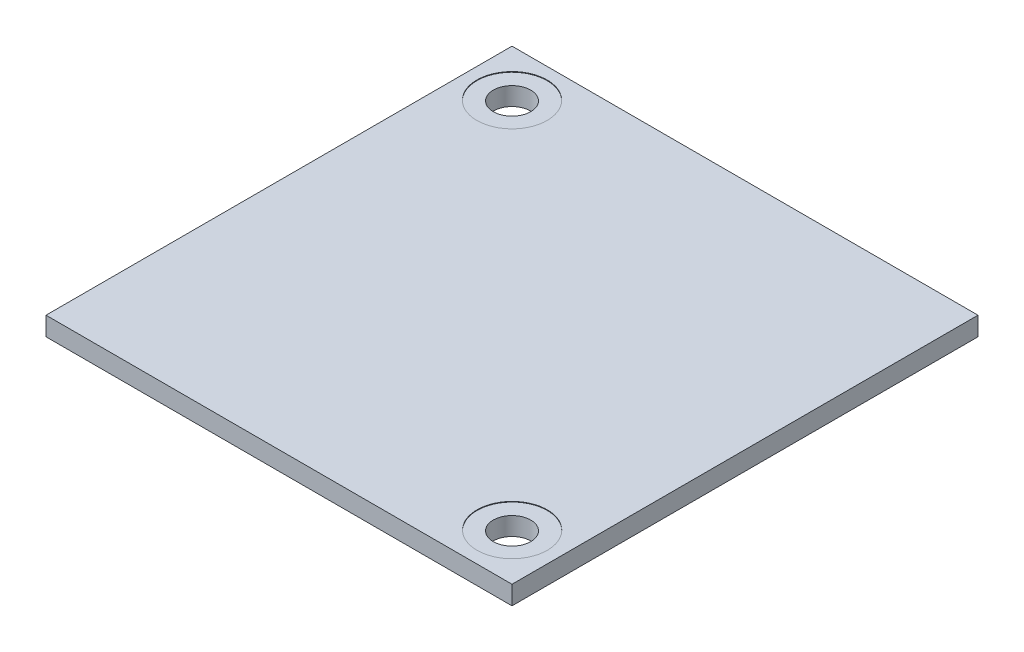
ISO-10303-21;
HEADER;
FILE_DESCRIPTION(('STEP AP214'),'2;1');
FILE_NAME('part.step','',(''),(''),'','','');
FILE_SCHEMA(('AUTOMOTIVE_DESIGN { 1 0 10303 214 1 1 1 1 }'));
ENDSEC;
DATA;
#1=APPLICATION_CONTEXT('core data for automotive mechanical design processes');
#2=APPLICATION_PROTOCOL_DEFINITION('international standard','automotive_design',2000,#1);
#3=PRODUCT_CONTEXT('',#1,'mechanical');
#4=PRODUCT('Part','Part','',(#3));
#5=PRODUCT_RELATED_PRODUCT_CATEGORY('part','',(#4));
#6=PRODUCT_DEFINITION_FORMATION('','',#4);
#7=PRODUCT_DEFINITION_CONTEXT('part definition',#1,'design');
#8=PRODUCT_DEFINITION('design','',#6,#7);
#9=PRODUCT_DEFINITION_SHAPE('','',#8);
#10=(LENGTH_UNIT() NAMED_UNIT(*) SI_UNIT(.MILLI.,.METRE.));
#11=(NAMED_UNIT(*) PLANE_ANGLE_UNIT() SI_UNIT($,.RADIAN.));
#12=(NAMED_UNIT(*) SI_UNIT($,.STERADIAN.) SOLID_ANGLE_UNIT());
#13=UNCERTAINTY_MEASURE_WITH_UNIT(LENGTH_MEASURE(1.E-05),#10,'distance_accuracy_value','');
#14=(GEOMETRIC_REPRESENTATION_CONTEXT(3) GLOBAL_UNCERTAINTY_ASSIGNED_CONTEXT((#13)) GLOBAL_UNIT_ASSIGNED_CONTEXT((#10,
#11,#12)) REPRESENTATION_CONTEXT('',''));
#15=CARTESIAN_POINT('',(0.,0.,0.));
#16=DIRECTION('',(0.,0.,1.));
#17=DIRECTION('',(1.,0.,0.));
#18=AXIS2_PLACEMENT_3D('',#15,#16,#17);
#19=CARTESIAN_POINT('',(19.6,1.6,-20.2));
#20=DIRECTION('',(-1.,0.,0.));
#21=DIRECTION('',(0.,0.,1.));
#22=AXIS2_PLACEMENT_3D('',#19,#20,#21);
#23=PLANE('',#22);
#24=DIRECTION('',(0.,0.,-1.));
#25=VECTOR('',#24,1.);
#26=CARTESIAN_POINT('',(19.6,0.,-20.2));
#27=LINE('',#26,#25);
#28=CARTESIAN_POINT('',(19.6,0.,19.6));
#29=VERTEX_POINT('',#28);
#30=CARTESIAN_POINT('',(19.6,0.,-20.2));
#31=VERTEX_POINT('',#30);
#32=EDGE_CURVE('E98',#29,#31,#27,.T.);
#33=ORIENTED_EDGE('',*,*,#32,.T.);
#34=DIRECTION('',(0.,-1.,0.));
#35=VECTOR('',#34,1.);
#36=CARTESIAN_POINT('',(19.6,1.6,-20.2));
#37=LINE('',#36,#35);
#38=CARTESIAN_POINT('',(19.6,1.6,-20.2));
#39=VERTEX_POINT('',#38);
#40=EDGE_CURVE('E11',#39,#31,#37,.T.);
#41=ORIENTED_EDGE('',*,*,#40,.F.);
#42=DIRECTION('',(0.,0.,-1.));
#43=VECTOR('',#42,1.);
#44=CARTESIAN_POINT('',(19.6,1.6,-20.2));
#45=LINE('',#44,#43);
#46=CARTESIAN_POINT('',(19.6,1.6,19.6));
#47=VERTEX_POINT('',#46);
#48=EDGE_CURVE('E85',#47,#39,#45,.T.);
#49=ORIENTED_EDGE('',*,*,#48,.F.);
#50=DIRECTION('',(0.,-1.,0.));
#51=VECTOR('',#50,1.);
#52=CARTESIAN_POINT('',(19.6,1.6,19.6));
#53=LINE('',#52,#51);
#54=EDGE_CURVE('E94',#47,#29,#53,.T.);
#55=ORIENTED_EDGE('',*,*,#54,.T.);
#56=EDGE_LOOP('',(#33,#41,#49,#55));
#57=FACE_BOUND('',#56,.T.);
#58=ADVANCED_FACE('F32',(#57),#23,.F.);
#59=CARTESIAN_POINT('',(-20.2,1.6,-20.2));
#60=DIRECTION('',(0.,0.,1.));
#61=DIRECTION('',(1.,0.,0.));
#62=AXIS2_PLACEMENT_3D('',#59,#60,#61);
#63=PLANE('',#62);
#64=DIRECTION('',(-1.,0.,0.));
#65=VECTOR('',#64,1.);
#66=CARTESIAN_POINT('',(-20.2,0.,-20.2));
#67=LINE('',#66,#65);
#68=CARTESIAN_POINT('',(-20.2,0.,-20.2));
#69=VERTEX_POINT('',#68);
#70=EDGE_CURVE('E89',#31,#69,#67,.T.);
#71=ORIENTED_EDGE('',*,*,#70,.T.);
#72=DIRECTION('',(0.,-1.,0.));
#73=VECTOR('',#72,1.);
#74=CARTESIAN_POINT('',(-20.2,1.6,-20.2));
#75=LINE('',#74,#73);
#76=CARTESIAN_POINT('',(-20.2,1.6,-20.2));
#77=VERTEX_POINT('',#76);
#78=EDGE_CURVE('E41',#77,#69,#75,.T.);
#79=ORIENTED_EDGE('',*,*,#78,.F.);
#80=DIRECTION('',(-1.,0.,0.));
#81=VECTOR('',#80,1.);
#82=CARTESIAN_POINT('',(-20.2,1.6,-20.2));
#83=LINE('',#82,#81);
#84=EDGE_CURVE('E80',#39,#77,#83,.T.);
#85=ORIENTED_EDGE('',*,*,#84,.F.);
#86=ORIENTED_EDGE('',*,*,#40,.T.);
#87=EDGE_LOOP('',(#71,#79,#85,#86));
#88=FACE_BOUND('',#87,.T.);
#89=ADVANCED_FACE('F88',(#88),#63,.F.);
#90=CARTESIAN_POINT('',(-20.2,1.6,-20.2));
#91=DIRECTION('',(1.,0.,0.));
#92=DIRECTION('',(0.,0.,-1.));
#93=AXIS2_PLACEMENT_3D('',#90,#91,#92);
#94=PLANE('',#93);
#95=DIRECTION('',(0.,0.,1.));
#96=VECTOR('',#95,1.);
#97=CARTESIAN_POINT('',(-20.2,0.,-20.2));
#98=LINE('',#97,#96);
#99=CARTESIAN_POINT('',(-20.2,0.,19.6));
#100=VERTEX_POINT('',#99);
#101=EDGE_CURVE('E67',#69,#100,#98,.T.);
#102=ORIENTED_EDGE('',*,*,#101,.T.);
#103=DIRECTION('',(0.,-1.,0.));
#104=VECTOR('',#103,1.);
#105=CARTESIAN_POINT('',(-20.2,1.6,19.6));
#106=LINE('',#105,#104);
#107=CARTESIAN_POINT('',(-20.2,1.6,19.6));
#108=VERTEX_POINT('',#107);
#109=EDGE_CURVE('E90',#108,#100,#106,.T.);
#110=ORIENTED_EDGE('',*,*,#109,.F.);
#111=DIRECTION('',(0.,0.,1.));
#112=VECTOR('',#111,1.);
#113=CARTESIAN_POINT('',(-20.2,1.6,-20.2));
#114=LINE('',#113,#112);
#115=EDGE_CURVE('E83',#77,#108,#114,.T.);
#116=ORIENTED_EDGE('',*,*,#115,.F.);
#117=ORIENTED_EDGE('',*,*,#78,.T.);
#118=EDGE_LOOP('',(#102,#110,#116,#117));
#119=FACE_BOUND('',#118,.T.);
#120=ADVANCED_FACE('F92',(#119),#94,.F.);
#121=CARTESIAN_POINT('',(-20.2,1.6,19.6));
#122=DIRECTION('',(0.,0.,-1.));
#123=DIRECTION('',(-1.,0.,0.));
#124=AXIS2_PLACEMENT_3D('',#121,#122,#123);
#125=PLANE('',#124);
#126=DIRECTION('',(1.,0.,0.));
#127=VECTOR('',#126,1.);
#128=CARTESIAN_POINT('',(-20.2,0.,19.6));
#129=LINE('',#128,#127);
#130=EDGE_CURVE('E73',#100,#29,#129,.T.);
#131=ORIENTED_EDGE('',*,*,#130,.T.);
#132=ORIENTED_EDGE('',*,*,#54,.F.);
#133=DIRECTION('',(1.,0.,0.));
#134=VECTOR('',#133,1.);
#135=CARTESIAN_POINT('',(-20.2,1.6,19.6));
#136=LINE('',#135,#134);
#137=EDGE_CURVE('E50',#108,#47,#136,.T.);
#138=ORIENTED_EDGE('',*,*,#137,.F.);
#139=ORIENTED_EDGE('',*,*,#109,.T.);
#140=EDGE_LOOP('',(#131,#132,#138,#139));
#141=FACE_BOUND('',#140,.T.);
#142=ADVANCED_FACE('F135',(#141),#125,.F.);
#143=CARTESIAN_POINT('',(0.,1.6,0.));
#144=DIRECTION('',(0.,1.,0.));
#145=DIRECTION('',(0.,0.,1.));
#146=AXIS2_PLACEMENT_3D('',#143,#144,#145);
#147=PLANE('',#146);
#148=CARTESIAN_POINT('',(15.5999945512847,1.6,15.5867080832074));
#149=DIRECTION('',(0.,1.,0.));
#150=DIRECTION('',(0.,0.,1.));
#151=AXIS2_PLACEMENT_3D('',#148,#149,#150);
#152=CIRCLE('',#151,3.);
#153=CARTESIAN_POINT('',(15.5999945512847,1.6,18.5867080832074));
#154=VERTEX_POINT('',#153);
#155=EDGE_CURVE('E108',#154,#154,#152,.T.);
#156=ORIENTED_EDGE('',*,*,#155,.F.);
#157=EDGE_LOOP('',(#156));
#158=FACE_BOUND('',#157,.T.);
#159=CARTESIAN_POINT('',(-16.2,1.6,-16.2));
#160=DIRECTION('',(0.,1.,0.));
#161=DIRECTION('',(0.,0.,1.));
#162=AXIS2_PLACEMENT_3D('',#159,#160,#161);
#163=CIRCLE('',#162,3.);
#164=CARTESIAN_POINT('',(-16.2,1.6,-13.2));
#165=VERTEX_POINT('',#164);
#166=EDGE_CURVE('E124',#165,#165,#163,.T.);
#167=ORIENTED_EDGE('',*,*,#166,.F.);
#168=EDGE_LOOP('',(#167));
#169=FACE_BOUND('',#168,.T.);
#170=ORIENTED_EDGE('',*,*,#48,.T.);
#171=ORIENTED_EDGE('',*,*,#84,.T.);
#172=ORIENTED_EDGE('',*,*,#115,.T.);
#173=ORIENTED_EDGE('',*,*,#137,.T.);
#174=EDGE_LOOP('',(#170,#171,#172,#173));
#175=FACE_BOUND('',#174,.T.);
#176=ADVANCED_FACE('F81',(#158,#169,#175),#147,.T.);
#177=CARTESIAN_POINT('',(0.,0.,0.));
#178=DIRECTION('',(0.,1.,0.));
#179=DIRECTION('',(0.,0.,1.));
#180=AXIS2_PLACEMENT_3D('',#177,#178,#179);
#181=PLANE('',#180);
#182=CARTESIAN_POINT('',(15.5999999999999,0.,15.6000000000001));
#183=DIRECTION('',(0.,1.,0.));
#184=DIRECTION('',(0.,0.,1.));
#185=AXIS2_PLACEMENT_3D('',#182,#183,#184);
#186=CIRCLE('',#185,1.6);
#187=CARTESIAN_POINT('',(15.5999999999999,0.,17.2000000000001));
#188=VERTEX_POINT('',#187);
#189=EDGE_CURVE('E120',#188,#188,#186,.T.);
#190=ORIENTED_EDGE('',*,*,#189,.T.);
#191=EDGE_LOOP('',(#190));
#192=FACE_BOUND('',#191,.T.);
#193=CARTESIAN_POINT('',(-16.2,0.,-16.2));
#194=DIRECTION('',(0.,1.,0.));
#195=DIRECTION('',(0.,0.,1.));
#196=AXIS2_PLACEMENT_3D('',#193,#194,#195);
#197=CIRCLE('',#196,1.6);
#198=CARTESIAN_POINT('',(-16.2,0.,-14.6));
#199=VERTEX_POINT('',#198);
#200=EDGE_CURVE('E109',#199,#199,#197,.T.);
#201=ORIENTED_EDGE('',*,*,#200,.T.);
#202=EDGE_LOOP('',(#201));
#203=FACE_BOUND('',#202,.T.);
#204=ORIENTED_EDGE('',*,*,#32,.F.);
#205=ORIENTED_EDGE('',*,*,#130,.F.);
#206=ORIENTED_EDGE('',*,*,#101,.F.);
#207=ORIENTED_EDGE('',*,*,#70,.F.);
#208=EDGE_LOOP('',(#204,#205,#206,#207));
#209=FACE_BOUND('',#208,.T.);
#210=ADVANCED_FACE('F134',(#192,#203,#209),#181,.F.);
#211=CARTESIAN_POINT('',(-16.2,1.55,-16.2));
#212=DIRECTION('',(0.,1.,0.));
#213=DIRECTION('',(0.,0.,1.));
#214=AXIS2_PLACEMENT_3D('',#211,#212,#213);
#215=CYLINDRICAL_SURFACE('',#214,3.);
#216=CARTESIAN_POINT('',(-16.2,1.55,-16.2));
#217=DIRECTION('',(0.,1.,0.));
#218=DIRECTION('',(0.,0.,1.));
#219=AXIS2_PLACEMENT_3D('',#216,#217,#218);
#220=CIRCLE('',#219,3.);
#221=CARTESIAN_POINT('',(-16.2,1.55,-13.2));
#222=VERTEX_POINT('',#221);
#223=EDGE_CURVE('E101',#222,#222,#220,.T.);
#224=ORIENTED_EDGE('',*,*,#223,.F.);
#225=EDGE_LOOP('',(#224));
#226=FACE_BOUND('',#225,.T.);
#227=ORIENTED_EDGE('',*,*,#166,.T.);
#228=EDGE_LOOP('',(#227));
#229=FACE_BOUND('',#228,.T.);
#230=ADVANCED_FACE('F131',(#226,#229),#215,.F.);
#231=CARTESIAN_POINT('',(-16.2,1.55,-16.2));
#232=DIRECTION('',(0.,1.,0.));
#233=DIRECTION('',(0.,0.,1.));
#234=AXIS2_PLACEMENT_3D('',#231,#232,#233);
#235=PLANE('',#234);
#236=CARTESIAN_POINT('',(-16.2,1.55,-16.2));
#237=DIRECTION('',(0.,1.,0.));
#238=DIRECTION('',(0.,0.,1.));
#239=AXIS2_PLACEMENT_3D('',#236,#237,#238);
#240=CIRCLE('',#239,1.6);
#241=CARTESIAN_POINT('',(-16.2,1.55,-14.6));
#242=VERTEX_POINT('',#241);
#243=EDGE_CURVE('E106',#242,#242,#240,.T.);
#244=ORIENTED_EDGE('',*,*,#243,.F.);
#245=EDGE_LOOP('',(#244));
#246=FACE_BOUND('',#245,.T.);
#247=ORIENTED_EDGE('',*,*,#223,.T.);
#248=EDGE_LOOP('',(#247));
#249=FACE_BOUND('',#248,.T.);
#250=ADVANCED_FACE('F178',(#246,#249),#235,.T.);
#251=CARTESIAN_POINT('',(15.5999945512847,1.55,15.5867080832074));
#252=DIRECTION('',(0.,1.,0.));
#253=DIRECTION('',(0.,0.,1.));
#254=AXIS2_PLACEMENT_3D('',#251,#252,#253);
#255=CYLINDRICAL_SURFACE('',#254,3.);
#256=CARTESIAN_POINT('',(15.5999945512847,1.55,15.5867080832074));
#257=DIRECTION('',(0.,1.,0.));
#258=DIRECTION('',(0.,0.,1.));
#259=AXIS2_PLACEMENT_3D('',#256,#257,#258);
#260=CIRCLE('',#259,3.);
#261=CARTESIAN_POINT('',(15.5999945512847,1.55,18.5867080832074));
#262=VERTEX_POINT('',#261);
#263=EDGE_CURVE('E113',#262,#262,#260,.T.);
#264=ORIENTED_EDGE('',*,*,#263,.F.);
#265=EDGE_LOOP('',(#264));
#266=FACE_BOUND('',#265,.T.);
#267=ORIENTED_EDGE('',*,*,#155,.T.);
#268=EDGE_LOOP('',(#267));
#269=FACE_BOUND('',#268,.T.);
#270=ADVANCED_FACE('F185',(#266,#269),#255,.F.);
#271=CARTESIAN_POINT('',(15.5999945512847,1.55,15.5867080832074));
#272=DIRECTION('',(0.,1.,0.));
#273=DIRECTION('',(0.,0.,1.));
#274=AXIS2_PLACEMENT_3D('',#271,#272,#273);
#275=PLANE('',#274);
#276=CARTESIAN_POINT('',(15.5999999999999,1.55,15.6000000000001));
#277=DIRECTION('',(0.,1.,0.));
#278=DIRECTION('',(0.,0.,1.));
#279=AXIS2_PLACEMENT_3D('',#276,#277,#278);
#280=CIRCLE('',#279,1.6);
#281=CARTESIAN_POINT('',(15.5999999999999,1.55,17.2000000000001));
#282=VERTEX_POINT('',#281);
#283=EDGE_CURVE('E35',#282,#282,#280,.T.);
#284=ORIENTED_EDGE('',*,*,#283,.F.);
#285=EDGE_LOOP('',(#284));
#286=FACE_BOUND('',#285,.T.);
#287=ORIENTED_EDGE('',*,*,#263,.T.);
#288=EDGE_LOOP('',(#287));
#289=FACE_BOUND('',#288,.T.);
#290=ADVANCED_FACE('F190',(#286,#289),#275,.T.);
#291=CARTESIAN_POINT('',(-16.2,0.,-16.2));
#292=DIRECTION('',(0.,1.,0.));
#293=DIRECTION('',(0.,0.,1.));
#294=AXIS2_PLACEMENT_3D('',#291,#292,#293);
#295=CYLINDRICAL_SURFACE('',#294,1.6);
#296=ORIENTED_EDGE('',*,*,#243,.T.);
#297=EDGE_LOOP('',(#296));
#298=FACE_BOUND('',#297,.T.);
#299=ORIENTED_EDGE('',*,*,#200,.F.);
#300=EDGE_LOOP('',(#299));
#301=FACE_BOUND('',#300,.T.);
#302=ADVANCED_FACE('F212',(#298,#301),#295,.F.);
#303=CARTESIAN_POINT('',(15.5999999999999,0.,15.6000000000001));
#304=DIRECTION('',(0.,1.,0.));
#305=DIRECTION('',(0.,0.,1.));
#306=AXIS2_PLACEMENT_3D('',#303,#304,#305);
#307=CYLINDRICAL_SURFACE('',#306,1.6);
#308=ORIENTED_EDGE('',*,*,#283,.T.);
#309=EDGE_LOOP('',(#308));
#310=FACE_BOUND('',#309,.T.);
#311=ORIENTED_EDGE('',*,*,#189,.F.);
#312=EDGE_LOOP('',(#311));
#313=FACE_BOUND('',#312,.T.);
#314=ADVANCED_FACE('F222',(#310,#313),#307,.F.);
#315=CLOSED_SHELL('',(#58,#89,#120,#142,#176,#210,#230,#250,#270,#290,#302,#314));
#316=MANIFOLD_SOLID_BREP('B2',#315);
#317=ADVANCED_BREP_SHAPE_REPRESENTATION('',(#18,#316),#14);
#318=SHAPE_DEFINITION_REPRESENTATION(#9,#317);
ENDSEC;
END-ISO-10303-21;
